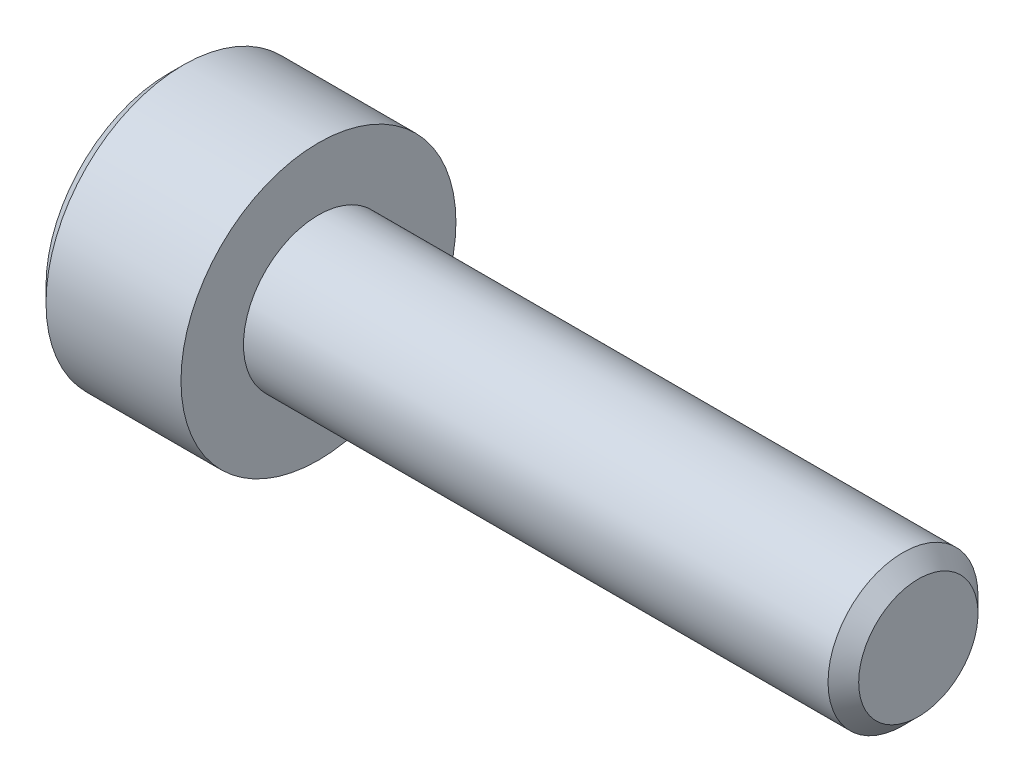
ISO-10303-21;
HEADER;
FILE_DESCRIPTION(('STEP AP214'),'2;1');
FILE_NAME('part.step','',(''),(''),'','','');
FILE_SCHEMA(('AUTOMOTIVE_DESIGN { 1 0 10303 214 1 1 1 1 }'));
ENDSEC;
DATA;
#1=APPLICATION_CONTEXT('core data for automotive mechanical design processes');
#2=APPLICATION_PROTOCOL_DEFINITION('international standard','automotive_design',2000,#1);
#3=PRODUCT_CONTEXT('',#1,'mechanical');
#4=PRODUCT('Part','Part','',(#3));
#5=PRODUCT_RELATED_PRODUCT_CATEGORY('part','',(#4));
#6=PRODUCT_DEFINITION_FORMATION('','',#4);
#7=PRODUCT_DEFINITION_CONTEXT('part definition',#1,'design');
#8=PRODUCT_DEFINITION('design','',#6,#7);
#9=PRODUCT_DEFINITION_SHAPE('','',#8);
#10=(LENGTH_UNIT() NAMED_UNIT(*) SI_UNIT(.MILLI.,.METRE.));
#11=(NAMED_UNIT(*) PLANE_ANGLE_UNIT() SI_UNIT($,.RADIAN.));
#12=(NAMED_UNIT(*) SI_UNIT($,.STERADIAN.) SOLID_ANGLE_UNIT());
#13=UNCERTAINTY_MEASURE_WITH_UNIT(LENGTH_MEASURE(1.E-05),#10,'distance_accuracy_value','');
#14=(GEOMETRIC_REPRESENTATION_CONTEXT(3) GLOBAL_UNCERTAINTY_ASSIGNED_CONTEXT((#13)) GLOBAL_UNIT_ASSIGNED_CONTEXT((#10,
#11,#12)) REPRESENTATION_CONTEXT('',''));
#15=CARTESIAN_POINT('',(0.,0.,0.));
#16=DIRECTION('',(0.,0.,1.));
#17=DIRECTION('',(1.,0.,0.));
#18=AXIS2_PLACEMENT_3D('',#15,#16,#17);
#19=CARTESIAN_POINT('',(-1.49999999999295,0.,0.));
#20=DIRECTION('',(-1.,0.,0.));
#21=DIRECTION('',(0.,0.,1.));
#22=AXIS2_PLACEMENT_3D('',#19,#20,#21);
#23=CONICAL_SURFACE('',#22,1.24999999985675,1.30899693890568);
#24=CARTESIAN_POINT('',(-1.50000000002341,0.,0.));
#25=DIRECTION('',(-1.,0.,0.));
#26=DIRECTION('',(0.,0.,1.));
#27=AXIS2_PLACEMENT_3D('',#24,#25,#26);
#28=CIRCLE('',#27,1.24999999997044);
#29=CARTESIAN_POINT('',(-1.50000000001171,1.08253175471775,0.624999999992609));
#30=VERTEX_POINT('',#29);
#31=CARTESIAN_POINT('',(-1.50000000001171,1.08253175471775,-0.624999999992609));
#32=VERTEX_POINT('',#31);
#33=EDGE_CURVE('E106',#30,#32,#28,.T.);
#34=ORIENTED_EDGE('',*,*,#33,.T.);
#35=CARTESIAN_POINT('',(-1.50000000002341,0.,0.));
#36=DIRECTION('',(-1.,0.,0.));
#37=DIRECTION('',(0.,0.,1.));
#38=AXIS2_PLACEMENT_3D('',#35,#36,#37);
#39=CIRCLE('',#38,1.24999999997044);
#40=CARTESIAN_POINT('',(-1.50000000001171,0.,-1.24999999998522));
#41=VERTEX_POINT('',#40);
#42=EDGE_CURVE('E114',#32,#41,#39,.T.);
#43=ORIENTED_EDGE('',*,*,#42,.T.);
#44=CARTESIAN_POINT('',(-1.50000000002341,0.,0.));
#45=DIRECTION('',(-1.,0.,0.));
#46=DIRECTION('',(0.,0.,1.));
#47=AXIS2_PLACEMENT_3D('',#44,#45,#46);
#48=CIRCLE('',#47,1.24999999997044);
#49=CARTESIAN_POINT('',(-1.50000000001171,-1.08253175471775,-0.62499999999261));
#50=VERTEX_POINT('',#49);
#51=EDGE_CURVE('E198',#41,#50,#48,.T.);
#52=ORIENTED_EDGE('',*,*,#51,.T.);
#53=CARTESIAN_POINT('',(-1.50000000002341,0.,0.));
#54=DIRECTION('',(-1.,0.,0.));
#55=DIRECTION('',(0.,0.,1.));
#56=AXIS2_PLACEMENT_3D('',#53,#54,#55);
#57=CIRCLE('',#56,1.24999999997044);
#58=CARTESIAN_POINT('',(-1.50000000001171,-1.08253175471775,0.624999999992609));
#59=VERTEX_POINT('',#58);
#60=EDGE_CURVE('E88',#50,#59,#57,.T.);
#61=ORIENTED_EDGE('',*,*,#60,.T.);
#62=CARTESIAN_POINT('',(-1.50000000002341,0.,0.));
#63=DIRECTION('',(-1.,0.,0.));
#64=DIRECTION('',(0.,0.,1.));
#65=AXIS2_PLACEMENT_3D('',#62,#63,#64);
#66=CIRCLE('',#65,1.24999999997044);
#67=CARTESIAN_POINT('',(-1.50000000001171,0.,1.24999999998522));
#68=VERTEX_POINT('',#67);
#69=EDGE_CURVE('E19',#59,#68,#66,.T.);
#70=ORIENTED_EDGE('',*,*,#69,.T.);
#71=CARTESIAN_POINT('',(-1.50000000002341,0.,0.));
#72=DIRECTION('',(-1.,0.,0.));
#73=DIRECTION('',(0.,0.,1.));
#74=AXIS2_PLACEMENT_3D('',#71,#72,#73);
#75=CIRCLE('',#74,1.24999999997044);
#76=EDGE_CURVE('E94',#68,#30,#75,.T.);
#77=ORIENTED_EDGE('',*,*,#76,.T.);
#78=EDGE_LOOP('',(#34,#43,#52,#61,#70,#77));
#79=FACE_BOUND('',#78,.T.);
#80=CARTESIAN_POINT('',(-1.16506350946111,3.41060513164848E-10,0.));
#81=VERTEX_POINT('',#80);
#82=VERTEX_LOOP('',#81);
#83=FACE_BOUND('',#82,.T.);
#84=ADVANCED_FACE('F16',(#79,#83),#23,.F.);
#85=CARTESIAN_POINT('',(-1.5,0.,0.));
#86=DIRECTION('',(1.,0.,0.));
#87=DIRECTION('',(0.,0.,-1.));
#88=AXIS2_PLACEMENT_3D('',#85,#86,#87);
#89=PLANE('',#88);
#90=DIRECTION('',(0.,-0.5,-0.866025403784439));
#91=VECTOR('',#90,1.);
#92=CARTESIAN_POINT('',(-1.5,-1.44337567297406,0.));
#93=LINE('',#92,#91);
#94=CARTESIAN_POINT('',(-1.5,-0.721687836487029,1.25));
#95=VERTEX_POINT('',#94);
#96=EDGE_CURVE('E101',#59,#95,#93,.F.);
#97=ORIENTED_EDGE('',*,*,#96,.T.);
#98=DIRECTION('',(0.,1.,0.));
#99=VECTOR('',#98,1.);
#100=CARTESIAN_POINT('',(-1.5,-0.721687836487032,1.25));
#101=LINE('',#100,#99);
#102=EDGE_CURVE('E99',#95,#68,#101,.T.);
#103=ORIENTED_EDGE('',*,*,#102,.T.);
#104=ORIENTED_EDGE('',*,*,#69,.F.);
#105=EDGE_LOOP('',(#97,#103,#104));
#106=FACE_BOUND('',#105,.T.);
#107=ADVANCED_FACE('F100',(#106),#89,.F.);
#108=CARTESIAN_POINT('',(-1.5,0.,0.));
#109=DIRECTION('',(1.,0.,0.));
#110=DIRECTION('',(0.,0.,-1.));
#111=AXIS2_PLACEMENT_3D('',#108,#109,#110);
#112=PLANE('',#111);
#113=DIRECTION('',(0.,0.5,-0.866025403784439));
#114=VECTOR('',#113,1.);
#115=CARTESIAN_POINT('',(-1.5,-0.721687836487032,-1.25));
#116=LINE('',#115,#114);
#117=CARTESIAN_POINT('',(-1.5,-1.44337567297406,0.));
#118=VERTEX_POINT('',#117);
#119=EDGE_CURVE('E164',#50,#118,#116,.F.);
#120=ORIENTED_EDGE('',*,*,#119,.T.);
#121=DIRECTION('',(0.,-0.5,-0.866025403784439));
#122=VECTOR('',#121,1.);
#123=CARTESIAN_POINT('',(-1.5,-1.44337567297406,0.));
#124=LINE('',#123,#122);
#125=EDGE_CURVE('E119',#118,#59,#124,.F.);
#126=ORIENTED_EDGE('',*,*,#125,.T.);
#127=ORIENTED_EDGE('',*,*,#60,.F.);
#128=EDGE_LOOP('',(#120,#126,#127));
#129=FACE_BOUND('',#128,.T.);
#130=ADVANCED_FACE('F209',(#129),#112,.F.);
#131=CARTESIAN_POINT('',(-1.5,0.,0.));
#132=DIRECTION('',(1.,0.,0.));
#133=DIRECTION('',(0.,0.,-1.));
#134=AXIS2_PLACEMENT_3D('',#131,#132,#133);
#135=PLANE('',#134);
#136=DIRECTION('',(0.,1.,0.));
#137=VECTOR('',#136,1.);
#138=CARTESIAN_POINT('',(-1.5,0.721687836487032,-1.25));
#139=LINE('',#138,#137);
#140=CARTESIAN_POINT('',(-1.5,-0.721687836487032,-1.25));
#141=VERTEX_POINT('',#140);
#142=EDGE_CURVE('E150',#41,#141,#139,.F.);
#143=ORIENTED_EDGE('',*,*,#142,.T.);
#144=DIRECTION('',(0.,0.5,-0.866025403784439));
#145=VECTOR('',#144,1.);
#146=CARTESIAN_POINT('',(-1.5,-0.721687836487032,-1.25));
#147=LINE('',#146,#145);
#148=EDGE_CURVE('E161',#141,#50,#147,.F.);
#149=ORIENTED_EDGE('',*,*,#148,.T.);
#150=ORIENTED_EDGE('',*,*,#51,.F.);
#151=EDGE_LOOP('',(#143,#149,#150));
#152=FACE_BOUND('',#151,.T.);
#153=ADVANCED_FACE('F204',(#152),#135,.F.);
#154=CARTESIAN_POINT('',(-1.5,0.,0.));
#155=DIRECTION('',(1.,0.,0.));
#156=DIRECTION('',(0.,0.,-1.));
#157=AXIS2_PLACEMENT_3D('',#154,#155,#156);
#158=PLANE('',#157);
#159=DIRECTION('',(0.,0.5,0.866025403784439));
#160=VECTOR('',#159,1.);
#161=CARTESIAN_POINT('',(-1.5,1.44337567297406,0.));
#162=LINE('',#161,#160);
#163=CARTESIAN_POINT('',(-1.5,0.721687836487029,-1.25));
#164=VERTEX_POINT('',#163);
#165=EDGE_CURVE('E141',#32,#164,#162,.F.);
#166=ORIENTED_EDGE('',*,*,#165,.T.);
#167=DIRECTION('',(0.,1.,0.));
#168=VECTOR('',#167,1.);
#169=CARTESIAN_POINT('',(-1.5,0.721687836487032,-1.25));
#170=LINE('',#169,#168);
#171=EDGE_CURVE('E147',#164,#41,#170,.F.);
#172=ORIENTED_EDGE('',*,*,#171,.T.);
#173=ORIENTED_EDGE('',*,*,#42,.F.);
#174=EDGE_LOOP('',(#166,#172,#173));
#175=FACE_BOUND('',#174,.T.);
#176=ADVANCED_FACE('F254',(#175),#158,.F.);
#177=CARTESIAN_POINT('',(-1.5,0.,0.));
#178=DIRECTION('',(1.,0.,0.));
#179=DIRECTION('',(0.,0.,-1.));
#180=AXIS2_PLACEMENT_3D('',#177,#178,#179);
#181=PLANE('',#180);
#182=DIRECTION('',(0.,1.,0.));
#183=VECTOR('',#182,1.);
#184=CARTESIAN_POINT('',(-1.5,-0.721687836487032,1.25));
#185=LINE('',#184,#183);
#186=CARTESIAN_POINT('',(-1.5,0.721687836487032,1.25));
#187=VERTEX_POINT('',#186);
#188=EDGE_CURVE('E105',#68,#187,#185,.T.);
#189=ORIENTED_EDGE('',*,*,#188,.T.);
#190=DIRECTION('',(0.,-0.5,0.866025403784439));
#191=VECTOR('',#190,1.);
#192=CARTESIAN_POINT('',(-1.5,0.721687836487032,1.25));
#193=LINE('',#192,#191);
#194=EDGE_CURVE('E112',#187,#30,#193,.F.);
#195=ORIENTED_EDGE('',*,*,#194,.T.);
#196=ORIENTED_EDGE('',*,*,#76,.F.);
#197=EDGE_LOOP('',(#189,#195,#196));
#198=FACE_BOUND('',#197,.T.);
#199=ADVANCED_FACE('F109',(#198),#181,.F.);
#200=CARTESIAN_POINT('',(-1.5,0.,0.));
#201=DIRECTION('',(1.,0.,0.));
#202=DIRECTION('',(0.,0.,-1.));
#203=AXIS2_PLACEMENT_3D('',#200,#201,#202);
#204=PLANE('',#203);
#205=DIRECTION('',(0.,-0.5,0.866025403784439));
#206=VECTOR('',#205,1.);
#207=CARTESIAN_POINT('',(-1.5,0.721687836487032,1.25));
#208=LINE('',#207,#206);
#209=CARTESIAN_POINT('',(-1.5,1.44337567297406,0.));
#210=VERTEX_POINT('',#209);
#211=EDGE_CURVE('E238',#30,#210,#208,.F.);
#212=ORIENTED_EDGE('',*,*,#211,.T.);
#213=DIRECTION('',(0.,0.5,0.866025403784439));
#214=VECTOR('',#213,1.);
#215=CARTESIAN_POINT('',(-1.5,1.44337567297406,0.));
#216=LINE('',#215,#214);
#217=EDGE_CURVE('E144',#210,#32,#216,.F.);
#218=ORIENTED_EDGE('',*,*,#217,.T.);
#219=ORIENTED_EDGE('',*,*,#33,.F.);
#220=EDGE_LOOP('',(#212,#218,#219));
#221=FACE_BOUND('',#220,.T.);
#222=ADVANCED_FACE('F251',(#221),#204,.F.);
#223=CARTESIAN_POINT('',(-3.,-0.721687836487032,1.25));
#224=DIRECTION('',(0.,0.,1.));
#225=DIRECTION('',(1.,0.,0.));
#226=AXIS2_PLACEMENT_3D('',#223,#224,#225);
#227=PLANE('',#226);
#228=DIRECTION('',(1.,0.,0.));
#229=VECTOR('',#228,1.);
#230=CARTESIAN_POINT('',(-3.,0.721687836487032,1.25));
#231=LINE('',#230,#229);
#232=CARTESIAN_POINT('',(-3.,0.721687836487032,1.25));
#233=VERTEX_POINT('',#232);
#234=EDGE_CURVE('E118',#233,#187,#231,.T.);
#235=ORIENTED_EDGE('',*,*,#234,.T.);
#236=ORIENTED_EDGE('',*,*,#188,.F.);
#237=ORIENTED_EDGE('',*,*,#102,.F.);
#238=DIRECTION('',(1.,0.,0.));
#239=VECTOR('',#238,1.);
#240=CARTESIAN_POINT('',(-3.,-0.721687836487029,1.25));
#241=LINE('',#240,#239);
#242=CARTESIAN_POINT('',(-3.,-0.721687836487031,1.25));
#243=VERTEX_POINT('',#242);
#244=EDGE_CURVE('E165',#95,#243,#241,.F.);
#245=ORIENTED_EDGE('',*,*,#244,.T.);
#246=DIRECTION('',(0.,1.,0.));
#247=VECTOR('',#246,1.);
#248=CARTESIAN_POINT('',(-3.,1.225,1.25));
#249=LINE('',#248,#247);
#250=EDGE_CURVE('E128',#233,#243,#249,.F.);
#251=ORIENTED_EDGE('',*,*,#250,.F.);
#252=EDGE_LOOP('',(#235,#236,#237,#245,#251));
#253=FACE_BOUND('',#252,.T.);
#254=ADVANCED_FACE('F116',(#253),#227,.F.);
#255=CARTESIAN_POINT('',(-3.,-1.44337567297406,0.));
#256=DIRECTION('',(0.,-0.866025403784439,0.5));
#257=DIRECTION('',(0.,-0.5,-0.866025403784439));
#258=AXIS2_PLACEMENT_3D('',#255,#256,#257);
#259=PLANE('',#258);
#260=ORIENTED_EDGE('',*,*,#244,.F.);
#261=ORIENTED_EDGE('',*,*,#96,.F.);
#262=ORIENTED_EDGE('',*,*,#125,.F.);
#263=DIRECTION('',(1.,0.,0.));
#264=VECTOR('',#263,1.);
#265=CARTESIAN_POINT('',(-3.,-1.44337567297406,0.));
#266=LINE('',#265,#264);
#267=CARTESIAN_POINT('',(-3.,-1.44337567297406,0.));
#268=VERTEX_POINT('',#267);
#269=EDGE_CURVE('E151',#118,#268,#266,.F.);
#270=ORIENTED_EDGE('',*,*,#269,.T.);
#271=DIRECTION('',(0.,-0.499999999999998,-0.86602540378444));
#272=VECTOR('',#271,1.);
#273=CARTESIAN_POINT('',(-3.,-0.721687836487032,1.25));
#274=LINE('',#273,#272);
#275=EDGE_CURVE('E131',#243,#268,#274,.T.);
#276=ORIENTED_EDGE('',*,*,#275,.F.);
#277=EDGE_LOOP('',(#260,#261,#262,#270,#276));
#278=FACE_BOUND('',#277,.T.);
#279=ADVANCED_FACE('F219',(#278),#259,.F.);
#280=CARTESIAN_POINT('',(-3.,-0.721687836487032,-1.25));
#281=DIRECTION('',(0.,-0.866025403784439,-0.5));
#282=DIRECTION('',(0.,0.5,-0.866025403784439));
#283=AXIS2_PLACEMENT_3D('',#280,#281,#282);
#284=PLANE('',#283);
#285=ORIENTED_EDGE('',*,*,#269,.F.);
#286=ORIENTED_EDGE('',*,*,#119,.F.);
#287=ORIENTED_EDGE('',*,*,#148,.F.);
#288=DIRECTION('',(-1.,0.,0.));
#289=VECTOR('',#288,1.);
#290=CARTESIAN_POINT('',(-3.,-0.721687836487032,-1.25));
#291=LINE('',#290,#289);
#292=CARTESIAN_POINT('',(-3.,-0.721687836487032,-1.25));
#293=VERTEX_POINT('',#292);
#294=EDGE_CURVE('E158',#141,#293,#291,.T.);
#295=ORIENTED_EDGE('',*,*,#294,.T.);
#296=DIRECTION('',(0.,0.499999999999998,-0.86602540378444));
#297=VECTOR('',#296,1.);
#298=CARTESIAN_POINT('',(-3.,-1.44337567297406,0.));
#299=LINE('',#298,#297);
#300=EDGE_CURVE('E215',#268,#293,#299,.T.);
#301=ORIENTED_EDGE('',*,*,#300,.F.);
#302=EDGE_LOOP('',(#285,#286,#287,#295,#301));
#303=FACE_BOUND('',#302,.T.);
#304=ADVANCED_FACE('F212',(#303),#284,.F.);
#305=CARTESIAN_POINT('',(-3.,0.721687836487032,-1.25));
#306=DIRECTION('',(0.,0.,-1.));
#307=DIRECTION('',(-1.,0.,0.));
#308=AXIS2_PLACEMENT_3D('',#305,#306,#307);
#309=PLANE('',#308);
#310=ORIENTED_EDGE('',*,*,#294,.F.);
#311=ORIENTED_EDGE('',*,*,#142,.F.);
#312=ORIENTED_EDGE('',*,*,#171,.F.);
#313=DIRECTION('',(1.,0.,0.));
#314=VECTOR('',#313,1.);
#315=CARTESIAN_POINT('',(-3.,0.721687836487029,-1.25));
#316=LINE('',#315,#314);
#317=CARTESIAN_POINT('',(-3.,0.721687836487031,-1.25));
#318=VERTEX_POINT('',#317);
#319=EDGE_CURVE('E143',#164,#318,#316,.F.);
#320=ORIENTED_EDGE('',*,*,#319,.T.);
#321=DIRECTION('',(0.,1.,0.));
#322=VECTOR('',#321,1.);
#323=CARTESIAN_POINT('',(-3.,1.225,-1.25));
#324=LINE('',#323,#322);
#325=EDGE_CURVE('E228',#293,#318,#324,.T.);
#326=ORIENTED_EDGE('',*,*,#325,.F.);
#327=EDGE_LOOP('',(#310,#311,#312,#320,#326));
#328=FACE_BOUND('',#327,.T.);
#329=ADVANCED_FACE('F258',(#328),#309,.F.);
#330=CARTESIAN_POINT('',(-3.,1.44337567297406,0.));
#331=DIRECTION('',(0.,0.866025403784439,-0.5));
#332=DIRECTION('',(0.,0.5,0.866025403784439));
#333=AXIS2_PLACEMENT_3D('',#330,#331,#332);
#334=PLANE('',#333);
#335=ORIENTED_EDGE('',*,*,#319,.F.);
#336=ORIENTED_EDGE('',*,*,#165,.F.);
#337=ORIENTED_EDGE('',*,*,#217,.F.);
#338=DIRECTION('',(1.,0.,0.));
#339=VECTOR('',#338,1.);
#340=CARTESIAN_POINT('',(-3.,1.44337567297406,0.));
#341=LINE('',#340,#339);
#342=CARTESIAN_POINT('',(-3.,1.44337567297406,0.));
#343=VERTEX_POINT('',#342);
#344=EDGE_CURVE('E34',#210,#343,#341,.F.);
#345=ORIENTED_EDGE('',*,*,#344,.T.);
#346=DIRECTION('',(0.,0.499999999999998,0.86602540378444));
#347=VECTOR('',#346,1.);
#348=CARTESIAN_POINT('',(-3.,0.721687836487032,-1.25));
#349=LINE('',#348,#347);
#350=EDGE_CURVE('E138',#318,#343,#349,.T.);
#351=ORIENTED_EDGE('',*,*,#350,.F.);
#352=EDGE_LOOP('',(#335,#336,#337,#345,#351));
#353=FACE_BOUND('',#352,.T.);
#354=ADVANCED_FACE('F256',(#353),#334,.F.);
#355=CARTESIAN_POINT('',(-3.,0.721687836487032,1.25));
#356=DIRECTION('',(0.,0.866025403784439,0.5));
#357=DIRECTION('',(0.,-0.5,0.866025403784439));
#358=AXIS2_PLACEMENT_3D('',#355,#356,#357);
#359=PLANE('',#358);
#360=ORIENTED_EDGE('',*,*,#344,.F.);
#361=ORIENTED_EDGE('',*,*,#211,.F.);
#362=ORIENTED_EDGE('',*,*,#194,.F.);
#363=ORIENTED_EDGE('',*,*,#234,.F.);
#364=DIRECTION('',(0.,-0.499999999999998,0.86602540378444));
#365=VECTOR('',#364,1.);
#366=CARTESIAN_POINT('',(-3.,1.44337567297406,0.));
#367=LINE('',#366,#365);
#368=EDGE_CURVE('E134',#343,#233,#367,.T.);
#369=ORIENTED_EDGE('',*,*,#368,.F.);
#370=EDGE_LOOP('',(#360,#361,#362,#363,#369));
#371=FACE_BOUND('',#370,.T.);
#372=ADVANCED_FACE('F222',(#371),#359,.F.);
#373=CARTESIAN_POINT('',(-3.,1.225,0.));
#374=DIRECTION('',(-1.,0.,0.));
#375=DIRECTION('',(0.,0.,1.));
#376=AXIS2_PLACEMENT_3D('',#373,#374,#375);
#377=PLANE('',#376);
#378=CARTESIAN_POINT('',(-2.9999999999859,0.,0.));
#379=DIRECTION('',(1.,0.,0.));
#380=DIRECTION('',(0.,0.,-1.));
#381=AXIS2_PLACEMENT_3D('',#378,#379,#380);
#382=CIRCLE('',#381,2.45000000001028);
#383=CARTESIAN_POINT('',(-2.9999999999859,0.,-2.45000000001028));
#384=VERTEX_POINT('',#383);
#385=EDGE_CURVE('E137',#384,#384,#382,.T.);
#386=ORIENTED_EDGE('',*,*,#385,.F.);
#387=EDGE_LOOP('',(#386));
#388=FACE_BOUND('',#387,.T.);
#389=ORIENTED_EDGE('',*,*,#350,.T.);
#390=ORIENTED_EDGE('',*,*,#368,.T.);
#391=ORIENTED_EDGE('',*,*,#250,.T.);
#392=ORIENTED_EDGE('',*,*,#275,.T.);
#393=ORIENTED_EDGE('',*,*,#300,.T.);
#394=ORIENTED_EDGE('',*,*,#325,.T.);
#395=EDGE_LOOP('',(#389,#390,#391,#392,#393,#394));
#396=FACE_BOUND('',#395,.T.);
#397=ADVANCED_FACE('F225',(#388,#396),#377,.T.);
#398=CARTESIAN_POINT('',(-2.70000000000437,0.,0.));
#399=DIRECTION('',(1.,0.,0.));
#400=DIRECTION('',(0.,0.,-1.));
#401=AXIS2_PLACEMENT_3D('',#398,#399,#400);
#402=CONICAL_SURFACE('',#401,2.74999999999181,0.785398163397448);
#403=ORIENTED_EDGE('',*,*,#385,.T.);
#404=EDGE_LOOP('',(#403));
#405=FACE_BOUND('',#404,.T.);
#406=CARTESIAN_POINT('',(-2.7,0.,0.));
#407=DIRECTION('',(1.,0.,0.));
#408=DIRECTION('',(0.,0.,-1.));
#409=AXIS2_PLACEMENT_3D('',#406,#407,#408);
#410=CIRCLE('',#409,2.75);
#411=CARTESIAN_POINT('',(-2.7,0.,-2.75));
#412=VERTEX_POINT('',#411);
#413=EDGE_CURVE('E193',#412,#412,#410,.T.);
#414=ORIENTED_EDGE('',*,*,#413,.F.);
#415=EDGE_LOOP('',(#414));
#416=FACE_BOUND('',#415,.T.);
#417=ADVANCED_FACE('F294',(#405,#416),#402,.T.);
#418=CARTESIAN_POINT('',(12.,0.59675,0.));
#419=DIRECTION('',(1.,0.,0.));
#420=DIRECTION('',(0.,0.,-1.));
#421=AXIS2_PLACEMENT_3D('',#418,#419,#420);
#422=PLANE('',#421);
#423=CARTESIAN_POINT('',(11.9999999999436,0.,0.));
#424=DIRECTION('',(-1.,0.,0.));
#425=DIRECTION('',(0.,0.,1.));
#426=AXIS2_PLACEMENT_3D('',#423,#424,#425);
#427=CIRCLE('',#426,1.1934999999994);
#428=CARTESIAN_POINT('',(11.9999999999436,0.,1.1934999999994));
#429=VERTEX_POINT('',#428);
#430=EDGE_CURVE('E190',#429,#429,#427,.T.);
#431=ORIENTED_EDGE('',*,*,#430,.F.);
#432=EDGE_LOOP('',(#431));
#433=FACE_BOUND('',#432,.T.);
#434=ADVANCED_FACE('F290',(#433),#422,.T.);
#435=CARTESIAN_POINT('',(-1.35,0.,0.));
#436=DIRECTION('',(1.,0.,0.));
#437=DIRECTION('',(0.,0.,-1.));
#438=AXIS2_PLACEMENT_3D('',#435,#436,#437);
#439=CYLINDRICAL_SURFACE('',#438,2.75);
#440=ORIENTED_EDGE('',*,*,#413,.T.);
#441=EDGE_LOOP('',(#440));
#442=FACE_BOUND('',#441,.T.);
#443=CARTESIAN_POINT('',(0.,0.,0.));
#444=DIRECTION('',(1.,0.,0.));
#445=DIRECTION('',(0.,0.,-1.));
#446=AXIS2_PLACEMENT_3D('',#443,#444,#445);
#447=CIRCLE('',#446,2.75);
#448=CARTESIAN_POINT('',(0.,0.,-2.75));
#449=VERTEX_POINT('',#448);
#450=EDGE_CURVE('E187',#449,#449,#447,.T.);
#451=ORIENTED_EDGE('',*,*,#450,.F.);
#452=EDGE_LOOP('',(#451));
#453=FACE_BOUND('',#452,.T.);
#454=ADVANCED_FACE('F286',(#442,#453),#439,.T.);
#455=CARTESIAN_POINT('',(11.6934999999216,0.,0.));
#456=DIRECTION('',(-1.,0.,0.));
#457=DIRECTION('',(0.,0.,1.));
#458=AXIS2_PLACEMENT_3D('',#455,#456,#457);
#459=CONICAL_SURFACE('',#458,1.50000000002137,0.785398163397448);
#460=ORIENTED_EDGE('',*,*,#430,.T.);
#461=EDGE_LOOP('',(#460));
#462=FACE_BOUND('',#461,.T.);
#463=CARTESIAN_POINT('',(11.6935,0.,0.));
#464=DIRECTION('',(1.,0.,0.));
#465=DIRECTION('',(0.,0.,-1.));
#466=AXIS2_PLACEMENT_3D('',#463,#464,#465);
#467=CIRCLE('',#466,1.5);
#468=CARTESIAN_POINT('',(11.6935,0.,-1.5));
#469=VERTEX_POINT('',#468);
#470=EDGE_CURVE('E25',#469,#469,#467,.F.);
#471=ORIENTED_EDGE('',*,*,#470,.F.);
#472=EDGE_LOOP('',(#471));
#473=FACE_BOUND('',#472,.T.);
#474=ADVANCED_FACE('F278',(#462,#473),#459,.T.);
#475=CARTESIAN_POINT('',(0.,2.125,0.));
#476=DIRECTION('',(1.,0.,0.));
#477=DIRECTION('',(0.,0.,-1.));
#478=AXIS2_PLACEMENT_3D('',#475,#476,#477);
#479=PLANE('',#478);
#480=CARTESIAN_POINT('',(0.,0.,0.));
#481=DIRECTION('',(1.,0.,0.));
#482=DIRECTION('',(0.,0.,-1.));
#483=AXIS2_PLACEMENT_3D('',#480,#481,#482);
#484=CIRCLE('',#483,1.5);
#485=CARTESIAN_POINT('',(0.,0.,-1.5));
#486=VERTEX_POINT('',#485);
#487=EDGE_CURVE('E11',#486,#486,#484,.T.);
#488=ORIENTED_EDGE('',*,*,#487,.F.);
#489=EDGE_LOOP('',(#488));
#490=FACE_BOUND('',#489,.T.);
#491=ORIENTED_EDGE('',*,*,#450,.T.);
#492=EDGE_LOOP('',(#491));
#493=FACE_BOUND('',#492,.T.);
#494=ADVANCED_FACE('F271',(#490,#493),#479,.T.);
#495=CARTESIAN_POINT('',(5.84675,0.,0.));
#496=DIRECTION('',(1.,0.,0.));
#497=DIRECTION('',(0.,0.,-1.));
#498=AXIS2_PLACEMENT_3D('',#495,#496,#497);
#499=CYLINDRICAL_SURFACE('',#498,1.5);
#500=ORIENTED_EDGE('',*,*,#470,.T.);
#501=EDGE_LOOP('',(#500));
#502=FACE_BOUND('',#501,.T.);
#503=ORIENTED_EDGE('',*,*,#487,.T.);
#504=EDGE_LOOP('',(#503));
#505=FACE_BOUND('',#504,.T.);
#506=ADVANCED_FACE('F269',(#502,#505),#499,.T.);
#507=CLOSED_SHELL('',(#84,#107,#130,#153,#176,#199,#222,#254,#279,#304,#329,#354,#372,#397,#417,
#434,#454,#474,#494,#506));
#508=MANIFOLD_SOLID_BREP('B1',#507);
#509=ADVANCED_BREP_SHAPE_REPRESENTATION('',(#18,#508),#14);
#510=SHAPE_DEFINITION_REPRESENTATION(#9,#509);
ENDSEC;
END-ISO-10303-21;
